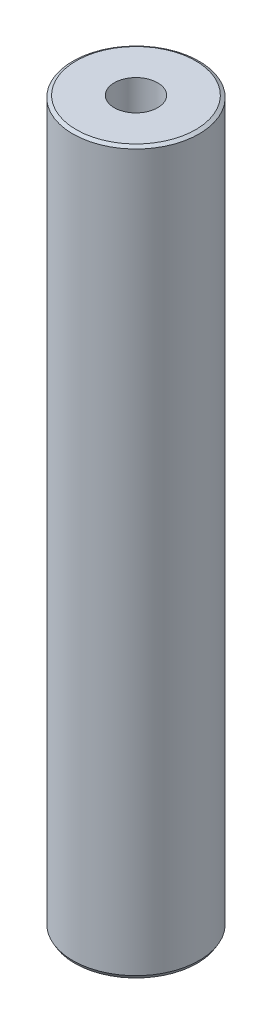
ISO-10303-21;
HEADER;
FILE_DESCRIPTION(('STEP AP214'),'2;1');
FILE_NAME('part.step','',(''),(''),'','','');
FILE_SCHEMA(('AUTOMOTIVE_DESIGN { 1 0 10303 214 1 1 1 1 }'));
ENDSEC;
DATA;
#1=APPLICATION_CONTEXT('core data for automotive mechanical design processes');
#2=APPLICATION_PROTOCOL_DEFINITION('international standard','automotive_design',2000,#1);
#3=PRODUCT_CONTEXT('',#1,'mechanical');
#4=PRODUCT('Part','Part','',(#3));
#5=PRODUCT_RELATED_PRODUCT_CATEGORY('part','',(#4));
#6=PRODUCT_DEFINITION_FORMATION('','',#4);
#7=PRODUCT_DEFINITION_CONTEXT('part definition',#1,'design');
#8=PRODUCT_DEFINITION('design','',#6,#7);
#9=PRODUCT_DEFINITION_SHAPE('','',#8);
#10=(LENGTH_UNIT() NAMED_UNIT(*) SI_UNIT(.MILLI.,.METRE.));
#11=(NAMED_UNIT(*) PLANE_ANGLE_UNIT() SI_UNIT($,.RADIAN.));
#12=(NAMED_UNIT(*) SI_UNIT($,.STERADIAN.) SOLID_ANGLE_UNIT());
#13=UNCERTAINTY_MEASURE_WITH_UNIT(LENGTH_MEASURE(1.E-05),#10,'distance_accuracy_value','');
#14=(GEOMETRIC_REPRESENTATION_CONTEXT(3) GLOBAL_UNCERTAINTY_ASSIGNED_CONTEXT((#13)) GLOBAL_UNIT_ASSIGNED_CONTEXT((#10,
#11,#12)) REPRESENTATION_CONTEXT('',''));
#15=CARTESIAN_POINT('',(0.,0.,0.));
#16=DIRECTION('',(0.,0.,1.));
#17=DIRECTION('',(1.,0.,0.));
#18=AXIS2_PLACEMENT_3D('',#15,#16,#17);
#19=CARTESIAN_POINT('',(0.,600.,0.));
#20=DIRECTION('',(0.,-1.,0.));
#21=DIRECTION('',(0.,0.,-1.));
#22=AXIS2_PLACEMENT_3D('',#19,#20,#21);
#23=CYLINDRICAL_SURFACE('',#22,52.5);
#24=CARTESIAN_POINT('',(0.,598.358253429866,0.));
#25=DIRECTION('',(0.,1.,0.));
#26=DIRECTION('',(0.,0.,1.));
#27=AXIS2_PLACEMENT_3D('',#24,#25,#26);
#28=CIRCLE('',#27,52.5);
#29=CARTESIAN_POINT('',(0.,598.358253429866,52.5));
#30=VERTEX_POINT('',#29);
#31=EDGE_CURVE('E50',#30,#30,#28,.F.);
#32=ORIENTED_EDGE('',*,*,#31,.T.);
#33=EDGE_LOOP('',(#32));
#34=FACE_BOUND('',#33,.T.);
#35=CARTESIAN_POINT('',(0.,2.84358847262423,0.));
#36=DIRECTION('',(0.,1.,0.));
#37=DIRECTION('',(0.,0.,1.));
#38=AXIS2_PLACEMENT_3D('',#35,#36,#37);
#39=CIRCLE('',#38,52.5);
#40=CARTESIAN_POINT('',(0.,2.84358847262423,52.5));
#41=VERTEX_POINT('',#40);
#42=EDGE_CURVE('E51',#41,#41,#39,.T.);
#43=ORIENTED_EDGE('',*,*,#42,.T.);
#44=EDGE_LOOP('',(#43));
#45=FACE_BOUND('',#44,.T.);
#46=ADVANCED_FACE('F39',(#34,#45),#23,.T.);
#47=CARTESIAN_POINT('',(0.,600.,0.));
#48=DIRECTION('',(0.,1.,0.));
#49=DIRECTION('',(0.,0.,1.));
#50=AXIS2_PLACEMENT_3D('',#47,#48,#49);
#51=PLANE('',#50);
#52=CARTESIAN_POINT('',(0.,600.,0.));
#53=DIRECTION('',(0.,1.,0.));
#54=DIRECTION('',(0.,0.,1.));
#55=AXIS2_PLACEMENT_3D('',#52,#53,#54);
#56=CIRCLE('',#55,49.6564115273759);
#57=CARTESIAN_POINT('',(0.,600.,49.6564115273759));
#58=VERTEX_POINT('',#57);
#59=EDGE_CURVE('E54',#58,#58,#56,.T.);
#60=ORIENTED_EDGE('',*,*,#59,.T.);
#61=EDGE_LOOP('',(#60));
#62=FACE_BOUND('',#61,.T.);
#63=CARTESIAN_POINT('',(0.,600.,0.));
#64=DIRECTION('',(0.,1.,0.));
#65=DIRECTION('',(0.,0.,1.));
#66=AXIS2_PLACEMENT_3D('',#63,#64,#65);
#67=CIRCLE('',#66,18.0358367950864);
#68=CARTESIAN_POINT('',(0.,600.,18.0358367950864));
#69=VERTEX_POINT('',#68);
#70=EDGE_CURVE('E58',#69,#69,#67,.T.);
#71=ORIENTED_EDGE('',*,*,#70,.F.);
#72=EDGE_LOOP('',(#71));
#73=FACE_BOUND('',#72,.T.);
#74=ADVANCED_FACE('F69',(#62,#73),#51,.T.);
#75=CARTESIAN_POINT('',(0.,0.,0.));
#76=DIRECTION('',(0.,1.,0.));
#77=DIRECTION('',(0.,0.,1.));
#78=AXIS2_PLACEMENT_3D('',#75,#76,#77);
#79=PLANE('',#78);
#80=CARTESIAN_POINT('',(0.,0.,0.));
#81=DIRECTION('',(0.,1.,0.));
#82=DIRECTION('',(0.,0.,1.));
#83=AXIS2_PLACEMENT_3D('',#80,#81,#82);
#84=CIRCLE('',#83,50.8582534298659);
#85=CARTESIAN_POINT('',(0.,0.,50.8582534298659));
#86=VERTEX_POINT('',#85);
#87=EDGE_CURVE('E10',#86,#86,#84,.F.);
#88=ORIENTED_EDGE('',*,*,#87,.T.);
#89=EDGE_LOOP('',(#88));
#90=FACE_BOUND('',#89,.T.);
#91=CARTESIAN_POINT('',(0.,0.,0.));
#92=DIRECTION('',(0.,1.,0.));
#93=DIRECTION('',(0.,0.,1.));
#94=AXIS2_PLACEMENT_3D('',#91,#92,#93);
#95=CIRCLE('',#94,18.0358367950864);
#96=CARTESIAN_POINT('',(0.,0.,18.0358367950864));
#97=VERTEX_POINT('',#96);
#98=EDGE_CURVE('E63',#97,#97,#95,.T.);
#99=ORIENTED_EDGE('',*,*,#98,.T.);
#100=EDGE_LOOP('',(#99));
#101=FACE_BOUND('',#100,.T.);
#102=ADVANCED_FACE('F75',(#90,#101),#79,.F.);
#103=CARTESIAN_POINT('',(0.,600.,0.));
#104=DIRECTION('',(0.,-1.,0.));
#105=DIRECTION('',(0.,0.,-1.));
#106=AXIS2_PLACEMENT_3D('',#103,#104,#105);
#107=CYLINDRICAL_SURFACE('',#106,18.0358367950864);
#108=ORIENTED_EDGE('',*,*,#70,.T.);
#109=EDGE_LOOP('',(#108));
#110=FACE_BOUND('',#109,.T.);
#111=ORIENTED_EDGE('',*,*,#98,.F.);
#112=EDGE_LOOP('',(#111));
#113=FACE_BOUND('',#112,.T.);
#114=ADVANCED_FACE('F70',(#110,#113),#107,.F.);
#115=CARTESIAN_POINT('',(0.,600.,0.));
#116=DIRECTION('',(0.,-1.,0.));
#117=DIRECTION('',(0.,0.,-1.));
#118=AXIS2_PLACEMENT_3D('',#115,#116,#117);
#119=CONICAL_SURFACE('',#118,49.6564115273759,1.04719755119663);
#120=ORIENTED_EDGE('',*,*,#31,.F.);
#121=EDGE_LOOP('',(#120));
#122=FACE_BOUND('',#121,.T.);
#123=ORIENTED_EDGE('',*,*,#59,.F.);
#124=EDGE_LOOP('',(#123));
#125=FACE_BOUND('',#124,.T.);
#126=ADVANCED_FACE('F81',(#122,#125),#119,.T.);
#127=CARTESIAN_POINT('',(0.,2.84358847262423,0.));
#128=DIRECTION('',(0.,1.,0.));
#129=DIRECTION('',(0.,0.,1.));
#130=AXIS2_PLACEMENT_3D('',#127,#128,#129);
#131=CONICAL_SURFACE('',#130,52.5,0.523598775598299);
#132=CARTESIAN_POINT('',(0.,0.,50.8582534298659));
#133=CARTESIAN_POINT('',(0.,0.0296207132565026,50.8753549566381));
#134=CARTESIAN_POINT('',(0.,0.0592414265130046,50.8924564834103));
#135=CARTESIAN_POINT('',(0.,0.118482853026009,50.9266595369548));
#136=CARTESIAN_POINT('',(0.,0.148103566282511,50.943761063727));
#137=CARTESIAN_POINT('',(0.,0.207344992795516,50.9779641172715));
#138=CARTESIAN_POINT('',(0.,0.236965706052019,50.9950656440437));
#139=CARTESIAN_POINT('',(0.,0.296207132565024,51.0292686975882));
#140=CARTESIAN_POINT('',(0.,0.325827845821526,51.0463702243604));
#141=CARTESIAN_POINT('',(0.,0.38506927233453,51.0805732779049));
#142=CARTESIAN_POINT('',(0.,0.414689985591033,51.0976748046771));
#143=CARTESIAN_POINT('',(0.,0.473931412104037,51.1318778582216));
#144=CARTESIAN_POINT('',(0.,0.503552125360539,51.1489793849938));
#145=CARTESIAN_POINT('',(0.,0.562793551873544,51.1831824385383));
#146=CARTESIAN_POINT('',(0.,0.592414265130047,51.2002839653105));
#147=CARTESIAN_POINT('',(0.,0.651655691643052,51.2344870188549));
#148=CARTESIAN_POINT('',(0.,0.681276404899554,51.2515885456272));
#149=CARTESIAN_POINT('',(0.,0.740517831412558,51.2857915991716));
#150=CARTESIAN_POINT('',(0.,0.770138544669061,51.3028931259439));
#151=CARTESIAN_POINT('',(0.,0.829379971182065,51.3370961794883));
#152=CARTESIAN_POINT('',(0.,0.859000684438568,51.3541977062606));
#153=CARTESIAN_POINT('',(0.,0.918242110951572,51.388400759805));
#154=CARTESIAN_POINT('',(0.,0.947862824208074,51.4055022865773));
#155=CARTESIAN_POINT('',(0.,1.00710425072108,51.4397053401217));
#156=CARTESIAN_POINT('',(0.,1.03672496397758,51.4568068668939));
#157=CARTESIAN_POINT('',(0.,1.09596639049059,51.4910099204384));
#158=CARTESIAN_POINT('',(0.,1.12558710374709,51.5081114472106));
#159=CARTESIAN_POINT('',(0.,1.18482853026009,51.5423145007551));
#160=CARTESIAN_POINT('',(0.,1.2144492435166,51.5594160275273));
#161=CARTESIAN_POINT('',(0.,1.2736906700296,51.5936190810718));
#162=CARTESIAN_POINT('',(0.,1.3033113832861,51.610720607844));
#163=CARTESIAN_POINT('',(0.,1.36255280979911,51.6449236613885));
#164=CARTESIAN_POINT('',(0.,1.39217352305561,51.6620251881607));
#165=CARTESIAN_POINT('',(0.,1.45141494956862,51.6962282417052));
#166=CARTESIAN_POINT('',(0.,1.48103566282512,51.7133297684774));
#167=CARTESIAN_POINT('',(0.,1.54027708933812,51.7475328220219));
#168=CARTESIAN_POINT('',(0.,1.56989780259462,51.7646343487941));
#169=CARTESIAN_POINT('',(0.,1.62913922910763,51.7988374023385));
#170=CARTESIAN_POINT('',(0.,1.65875994236413,51.8159389291108));
#171=CARTESIAN_POINT('',(0.,1.71800136887714,51.8501419826552));
#172=CARTESIAN_POINT('',(0.,1.74762208213364,51.8672435094275));
#173=CARTESIAN_POINT('',(0.,1.80686350864664,51.9014465629719));
#174=CARTESIAN_POINT('',(0.,1.83648422190315,51.9185480897442));
#175=CARTESIAN_POINT('',(0.,1.89572564841615,51.9527511432886));
#176=CARTESIAN_POINT('',(0.,1.92534636167265,51.9698526700609));
#177=CARTESIAN_POINT('',(0.,1.98458778818566,52.0040557236053));
#178=CARTESIAN_POINT('',(0.,2.01420850144216,52.0211572503775));
#179=CARTESIAN_POINT('',(0.,2.07344992795516,52.055360303922));
#180=CARTESIAN_POINT('',(0.,2.10307064121167,52.0724618306942));
#181=CARTESIAN_POINT('',(0.,2.16231206772467,52.1066648842387));
#182=CARTESIAN_POINT('',(0.,2.19193278098117,52.1237664110109));
#183=CARTESIAN_POINT('',(0.,2.25117420749418,52.1579694645554));
#184=CARTESIAN_POINT('',(0.,2.28079492075068,52.1750709913276));
#185=CARTESIAN_POINT('',(0.,2.34003634726369,52.2092740448721));
#186=CARTESIAN_POINT('',(0.,2.36965706052019,52.2263755716443));
#187=CARTESIAN_POINT('',(0.,2.42889848703319,52.2605786251888));
#188=CARTESIAN_POINT('',(0.,2.45851920028969,52.277680151961));
#189=CARTESIAN_POINT('',(0.,2.5177606268027,52.3118832055055));
#190=CARTESIAN_POINT('',(0.,2.5473813400592,52.3289847322777));
#191=CARTESIAN_POINT('',(0.,2.60662276657221,52.3631877858222));
#192=CARTESIAN_POINT('',(0.,2.63624347982871,52.3802893125944));
#193=CARTESIAN_POINT('',(0.,2.69548490634171,52.4144923661388));
#194=CARTESIAN_POINT('',(0.,2.72510561959822,52.4315938929111));
#195=CARTESIAN_POINT('',(0.,2.78434704611122,52.4657969464555));
#196=CARTESIAN_POINT('',(0.,2.81396775936772,52.4828984732278));
#197=CARTESIAN_POINT('',(0.,2.84358847262423,52.5));
#198=B_SPLINE_CURVE_WITH_KNOTS('',3,(#132,#133,#134,#135,#136,#137,#138,#139,#140,#141,#142,
#143,#144,#145,#146,#147,#148,#149,#150,#151,#152,#153,#154,#155,#156,#157,#158,#159,#160,#161,
#162,#163,#164,#165,#166,#167,#168,#169,#170,#171,#172,#173,#174,#175,#176,#177,#178,#179,#180,
#181,#182,#183,#184,#185,#186,#187,#188,#189,#190,#191,#192,#193,#194,#195,#196,#197),
.UNSPECIFIED.,.F.,.F.,(4,2,2,2,2,2,2,2,2,2,2,2,2,2,2,2,2,2,2,2,2,2,2,2,2,2,2,2,2,2,2,2,4),(0.,
0.102609160633383,0.205218321266766,0.307827481900145,0.410436642533528,0.513045803166911,
0.615654963800294,0.718264124433673,0.820873285067056,0.923482445700439,1.02609160633382,
1.1287007669672,1.23130992760058,1.33391908823397,1.43652824886735,1.53913740950073,
1.64174657013411,1.7443557307675,1.84696489140088,1.94957405203426,2.05218321266764,
2.15479237330102,2.25740153393441,2.36001069456779,2.46261985520117,2.56522901583455,
2.66783817646793,2.77044733710132,2.8730564977347,2.97566565836808,3.07827481900146,
3.18088397963485,3.28349314026823),.UNSPECIFIED.);
#199=EDGE_CURVE('BSEAM45',#86,#41,#198,.T.);
#200=ORIENTED_EDGE('',*,*,#87,.F.);
#201=ORIENTED_EDGE('',*,*,#42,.F.);
#202=ORIENTED_EDGE('',*,*,#199,.T.);
#203=ORIENTED_EDGE('',*,*,#199,.F.);
#204=EDGE_LOOP('',(#200,#202,#201,#203));
#205=FACE_BOUND('',#204,.T.);
#206=ADVANCED_FACE('F45',(#205),#131,.T.);
#207=CLOSED_SHELL('',(#46,#74,#102,#114,#126,#206));
#208=MANIFOLD_SOLID_BREP('B2',#207);
#209=ADVANCED_BREP_SHAPE_REPRESENTATION('',(#18,#208),#14);
#210=SHAPE_DEFINITION_REPRESENTATION(#9,#209);
ENDSEC;
END-ISO-10303-21;
